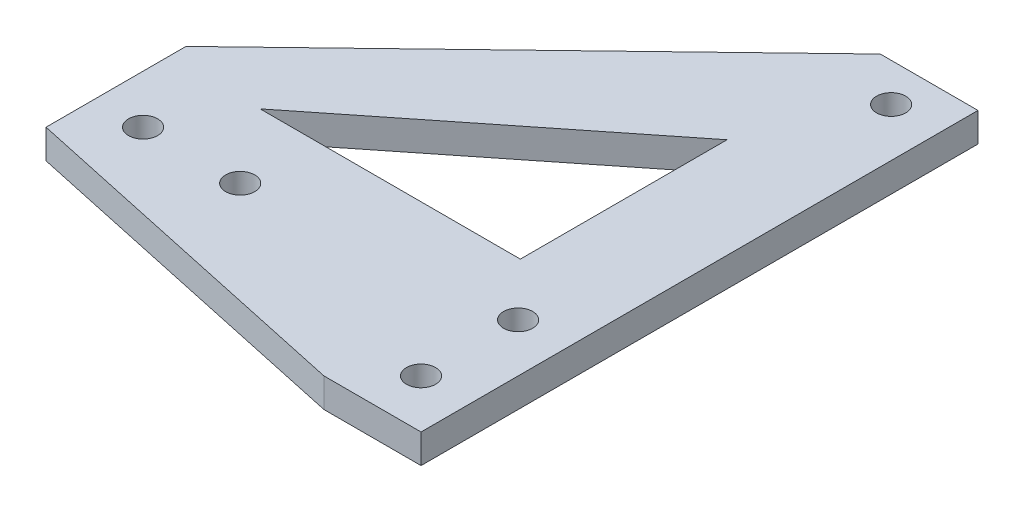
ISO-10303-21;
HEADER;
FILE_DESCRIPTION(('STEP AP214'),'2;1');
FILE_NAME('part.step','',(''),(''),'','','');
FILE_SCHEMA(('AUTOMOTIVE_DESIGN { 1 0 10303 214 1 1 1 1 }'));
ENDSEC;
DATA;
#1=APPLICATION_CONTEXT('core data for automotive mechanical design processes');
#2=APPLICATION_PROTOCOL_DEFINITION('international standard','automotive_design',2000,#1);
#3=PRODUCT_CONTEXT('',#1,'mechanical');
#4=PRODUCT('Part','Part','',(#3));
#5=PRODUCT_RELATED_PRODUCT_CATEGORY('part','',(#4));
#6=PRODUCT_DEFINITION_FORMATION('','',#4);
#7=PRODUCT_DEFINITION_CONTEXT('part definition',#1,'design');
#8=PRODUCT_DEFINITION('design','',#6,#7);
#9=PRODUCT_DEFINITION_SHAPE('','',#8);
#10=(LENGTH_UNIT() NAMED_UNIT(*) SI_UNIT(.MILLI.,.METRE.));
#11=(NAMED_UNIT(*) PLANE_ANGLE_UNIT() SI_UNIT($,.RADIAN.));
#12=(NAMED_UNIT(*) SI_UNIT($,.STERADIAN.) SOLID_ANGLE_UNIT());
#13=UNCERTAINTY_MEASURE_WITH_UNIT(LENGTH_MEASURE(1.E-05),#10,'distance_accuracy_value','');
#14=(GEOMETRIC_REPRESENTATION_CONTEXT(3) GLOBAL_UNCERTAINTY_ASSIGNED_CONTEXT((#13)) GLOBAL_UNIT_ASSIGNED_CONTEXT((#10,
#11,#12)) REPRESENTATION_CONTEXT('',''));
#15=CARTESIAN_POINT('',(0.,0.,0.));
#16=DIRECTION('',(0.,0.,1.));
#17=DIRECTION('',(1.,0.,0.));
#18=AXIS2_PLACEMENT_3D('',#15,#16,#17);
#19=CARTESIAN_POINT('',(0.,3.,64.6));
#20=DIRECTION('',(0.,0.,-1.));
#21=DIRECTION('',(1.,0.,0.));
#22=AXIS2_PLACEMENT_3D('',#19,#20,#21);
#23=PLANE('',#22);
#24=DIRECTION('',(-1.,0.,0.));
#25=VECTOR('',#24,1.);
#26=CARTESIAN_POINT('',(0.,0.,64.6));
#27=LINE('',#26,#25);
#28=CARTESIAN_POINT('',(41.5,0.,64.6));
#29=VERTEX_POINT('',#28);
#30=CARTESIAN_POINT('',(31.5,0.,64.6));
#31=VERTEX_POINT('',#30);
#32=EDGE_CURVE('E177',#29,#31,#27,.T.);
#33=ORIENTED_EDGE('',*,*,#32,.F.);
#34=DIRECTION('',(0.,-1.,0.));
#35=VECTOR('',#34,1.);
#36=CARTESIAN_POINT('',(41.5,3.,64.6));
#37=LINE('',#36,#35);
#38=CARTESIAN_POINT('',(41.5,3.,64.6));
#39=VERTEX_POINT('',#38);
#40=EDGE_CURVE('E176',#39,#29,#37,.T.);
#41=ORIENTED_EDGE('',*,*,#40,.F.);
#42=DIRECTION('',(-1.,0.,0.));
#43=VECTOR('',#42,1.);
#44=CARTESIAN_POINT('',(0.,3.,64.6));
#45=LINE('',#44,#43);
#46=CARTESIAN_POINT('',(31.5,3.,64.6));
#47=VERTEX_POINT('',#46);
#48=EDGE_CURVE('E151',#39,#47,#45,.T.);
#49=ORIENTED_EDGE('',*,*,#48,.T.);
#50=DIRECTION('',(0.,-1.,0.));
#51=VECTOR('',#50,1.);
#52=CARTESIAN_POINT('',(31.5,3.,64.6));
#53=LINE('',#52,#51);
#54=EDGE_CURVE('E205',#47,#31,#53,.T.);
#55=ORIENTED_EDGE('',*,*,#54,.T.);
#56=EDGE_LOOP('',(#33,#41,#49,#55));
#57=FACE_BOUND('',#56,.T.);
#58=ADVANCED_FACE('F43',(#57),#23,.F.);
#59=CARTESIAN_POINT('',(-11.9106417152535,3.,55.2399520466015));
#60=DIRECTION('',(0.210772639150553,0.,-0.97753511168935));
#61=DIRECTION('',(0.977535111689351,0.,0.210772639150553));
#62=AXIS2_PLACEMENT_3D('',#59,#60,#61);
#63=PLANE('',#62);
#64=DIRECTION('',(-0.977535111689351,0.,-0.210772639150553));
#65=VECTOR('',#64,1.);
#66=CARTESIAN_POINT('',(-11.9106417152535,0.,55.2399520466015));
#67=LINE('',#66,#65);
#68=CARTESIAN_POINT('',(-5.,0.,56.73));
#69=VERTEX_POINT('',#68);
#70=EDGE_CURVE('E180',#31,#69,#67,.T.);
#71=ORIENTED_EDGE('',*,*,#70,.F.);
#72=ORIENTED_EDGE('',*,*,#54,.F.);
#73=DIRECTION('',(-0.977535111689351,0.,-0.210772639150553));
#74=VECTOR('',#73,1.);
#75=CARTESIAN_POINT('',(-11.9106417152535,3.,55.2399520466015));
#76=LINE('',#75,#74);
#77=CARTESIAN_POINT('',(-5.,3.,56.73));
#78=VERTEX_POINT('',#77);
#79=EDGE_CURVE('E154',#47,#78,#76,.T.);
#80=ORIENTED_EDGE('',*,*,#79,.T.);
#81=DIRECTION('',(0.,-1.,0.));
#82=VECTOR('',#81,1.);
#83=CARTESIAN_POINT('',(-5.,3.,56.73));
#84=LINE('',#83,#82);
#85=EDGE_CURVE('E202',#78,#69,#84,.T.);
#86=ORIENTED_EDGE('',*,*,#85,.T.);
#87=EDGE_LOOP('',(#71,#72,#80,#86));
#88=FACE_BOUND('',#87,.T.);
#89=ADVANCED_FACE('F233',(#88),#63,.F.);
#90=CARTESIAN_POINT('',(-5.,3.,0.));
#91=DIRECTION('',(1.,0.,0.));
#92=DIRECTION('',(0.,0.,1.));
#93=AXIS2_PLACEMENT_3D('',#90,#91,#92);
#94=PLANE('',#93);
#95=DIRECTION('',(0.,0.,-1.));
#96=VECTOR('',#95,1.);
#97=CARTESIAN_POINT('',(-5.,0.,0.));
#98=LINE('',#97,#96);
#99=CARTESIAN_POINT('',(-5.,0.,42.3127995725989));
#100=VERTEX_POINT('',#99);
#101=EDGE_CURVE('E183',#69,#100,#98,.T.);
#102=ORIENTED_EDGE('',*,*,#101,.F.);
#103=ORIENTED_EDGE('',*,*,#85,.F.);
#104=DIRECTION('',(0.,0.,-1.));
#105=VECTOR('',#104,1.);
#106=CARTESIAN_POINT('',(-5.,3.,0.));
#107=LINE('',#106,#105);
#108=CARTESIAN_POINT('',(-5.,3.,42.3127995725989));
#109=VERTEX_POINT('',#108);
#110=EDGE_CURVE('E158',#78,#109,#107,.T.);
#111=ORIENTED_EDGE('',*,*,#110,.T.);
#112=DIRECTION('',(0.,1.,0.));
#113=VECTOR('',#112,1.);
#114=CARTESIAN_POINT('',(-5.,-4.,42.3127995725989));
#115=LINE('',#114,#113);
#116=EDGE_CURVE('E136',#100,#109,#115,.T.);
#117=ORIENTED_EDGE('',*,*,#116,.F.);
#118=EDGE_LOOP('',(#102,#103,#111,#117));
#119=FACE_BOUND('',#118,.T.);
#120=ADVANCED_FACE('F238',(#119),#94,.F.);
#121=CARTESIAN_POINT('',(36.5,3.,49.6));
#122=DIRECTION('',(0.,-1.,0.));
#123=DIRECTION('',(0.,0.,1.));
#124=AXIS2_PLACEMENT_3D('',#121,#122,#123);
#125=CYLINDRICAL_SURFACE('',#124,1.5);
#126=CARTESIAN_POINT('',(36.5,3.,49.6));
#127=DIRECTION('',(0.,-1.,0.));
#128=DIRECTION('',(0.,0.,-1.));
#129=AXIS2_PLACEMENT_3D('',#126,#127,#128);
#130=CIRCLE('',#129,1.5);
#131=CARTESIAN_POINT('',(36.5,3.,48.1));
#132=VERTEX_POINT('',#131);
#133=EDGE_CURVE('E170',#132,#132,#130,.T.);
#134=ORIENTED_EDGE('',*,*,#133,.F.);
#135=EDGE_LOOP('',(#134));
#136=FACE_BOUND('',#135,.T.);
#137=CARTESIAN_POINT('',(36.5,0.,49.6));
#138=DIRECTION('',(0.,-1.,0.));
#139=DIRECTION('',(0.,0.,-1.));
#140=AXIS2_PLACEMENT_3D('',#137,#138,#139);
#141=CIRCLE('',#140,1.5);
#142=CARTESIAN_POINT('',(36.5,0.,48.1));
#143=VERTEX_POINT('',#142);
#144=EDGE_CURVE('E195',#143,#143,#141,.T.);
#145=ORIENTED_EDGE('',*,*,#144,.T.);
#146=EDGE_LOOP('',(#145));
#147=FACE_BOUND('',#146,.T.);
#148=ADVANCED_FACE('F273',(#136,#147),#125,.F.);
#149=CARTESIAN_POINT('',(36.5,3.,59.6));
#150=DIRECTION('',(0.,-1.,0.));
#151=DIRECTION('',(0.,0.,1.));
#152=AXIS2_PLACEMENT_3D('',#149,#150,#151);
#153=CYLINDRICAL_SURFACE('',#152,1.5);
#154=CARTESIAN_POINT('',(36.5,3.,59.6));
#155=DIRECTION('',(0.,-1.,0.));
#156=DIRECTION('',(0.,0.,-1.));
#157=AXIS2_PLACEMENT_3D('',#154,#155,#156);
#158=CIRCLE('',#157,1.5);
#159=CARTESIAN_POINT('',(36.5,3.,58.1));
#160=VERTEX_POINT('',#159);
#161=EDGE_CURVE('E167',#160,#160,#158,.T.);
#162=ORIENTED_EDGE('',*,*,#161,.F.);
#163=EDGE_LOOP('',(#162));
#164=FACE_BOUND('',#163,.T.);
#165=CARTESIAN_POINT('',(36.5,0.,59.6));
#166=DIRECTION('',(0.,-1.,0.));
#167=DIRECTION('',(0.,0.,-1.));
#168=AXIS2_PLACEMENT_3D('',#165,#166,#167);
#169=CIRCLE('',#168,1.5);
#170=CARTESIAN_POINT('',(36.5,0.,58.1));
#171=VERTEX_POINT('',#170);
#172=EDGE_CURVE('E192',#171,#171,#169,.T.);
#173=ORIENTED_EDGE('',*,*,#172,.T.);
#174=EDGE_LOOP('',(#173));
#175=FACE_BOUND('',#174,.T.);
#176=ADVANCED_FACE('F276',(#164,#175),#153,.F.);
#177=CARTESIAN_POINT('',(36.5,3.,11.18));
#178=DIRECTION('',(0.,-1.,0.));
#179=DIRECTION('',(0.,0.,1.));
#180=AXIS2_PLACEMENT_3D('',#177,#178,#179);
#181=CYLINDRICAL_SURFACE('',#180,1.5);
#182=CARTESIAN_POINT('',(36.5,3.,11.18));
#183=DIRECTION('',(0.,-1.,0.));
#184=DIRECTION('',(0.,0.,-1.));
#185=AXIS2_PLACEMENT_3D('',#182,#183,#184);
#186=CIRCLE('',#185,1.5);
#187=CARTESIAN_POINT('',(36.5,3.,9.67999999999999));
#188=VERTEX_POINT('',#187);
#189=EDGE_CURVE('E164',#188,#188,#186,.T.);
#190=ORIENTED_EDGE('',*,*,#189,.F.);
#191=EDGE_LOOP('',(#190));
#192=FACE_BOUND('',#191,.T.);
#193=CARTESIAN_POINT('',(36.5,0.,11.18));
#194=DIRECTION('',(0.,-1.,0.));
#195=DIRECTION('',(0.,0.,-1.));
#196=AXIS2_PLACEMENT_3D('',#193,#194,#195);
#197=CIRCLE('',#196,1.5);
#198=CARTESIAN_POINT('',(36.5,0.,9.67999999999999));
#199=VERTEX_POINT('',#198);
#200=EDGE_CURVE('E189',#199,#199,#197,.T.);
#201=ORIENTED_EDGE('',*,*,#200,.T.);
#202=EDGE_LOOP('',(#201));
#203=FACE_BOUND('',#202,.T.);
#204=ADVANCED_FACE('F280',(#192,#203),#181,.F.);
#205=CARTESIAN_POINT('',(41.5,3.,0.));
#206=DIRECTION('',(1.,0.,0.));
#207=DIRECTION('',(0.,0.,1.));
#208=AXIS2_PLACEMENT_3D('',#205,#206,#207);
#209=PLANE('',#208);
#210=DIRECTION('',(0.,1.,0.));
#211=VECTOR('',#210,1.);
#212=CARTESIAN_POINT('',(41.5,-4.,7.23402453897604));
#213=LINE('',#212,#211);
#214=CARTESIAN_POINT('',(41.5,0.,7.23402453897604));
#215=VERTEX_POINT('',#214);
#216=CARTESIAN_POINT('',(41.5,3.,7.23402453897604));
#217=VERTEX_POINT('',#216);
#218=EDGE_CURVE('E144',#215,#217,#213,.T.);
#219=ORIENTED_EDGE('',*,*,#218,.T.);
#220=DIRECTION('',(0.,0.,-1.));
#221=VECTOR('',#220,1.);
#222=CARTESIAN_POINT('',(41.5,3.,0.));
#223=LINE('',#222,#221);
#224=EDGE_CURVE('E161',#39,#217,#223,.T.);
#225=ORIENTED_EDGE('',*,*,#224,.F.);
#226=ORIENTED_EDGE('',*,*,#40,.T.);
#227=DIRECTION('',(0.,0.,-1.));
#228=VECTOR('',#227,1.);
#229=CARTESIAN_POINT('',(41.5,0.,0.));
#230=LINE('',#229,#228);
#231=EDGE_CURVE('E186',#29,#215,#230,.T.);
#232=ORIENTED_EDGE('',*,*,#231,.T.);
#233=EDGE_LOOP('',(#219,#225,#226,#232));
#234=FACE_BOUND('',#233,.T.);
#235=ADVANCED_FACE('F248',(#234),#209,.T.);
#236=CARTESIAN_POINT('',(0.,3.,51.73));
#237=DIRECTION('',(0.,-1.,0.));
#238=DIRECTION('',(0.,0.,1.));
#239=AXIS2_PLACEMENT_3D('',#236,#237,#238);
#240=CYLINDRICAL_SURFACE('',#239,1.5);
#241=CARTESIAN_POINT('',(0.,3.,51.73));
#242=DIRECTION('',(0.,-1.,0.));
#243=DIRECTION('',(0.,0.,-1.));
#244=AXIS2_PLACEMENT_3D('',#241,#242,#243);
#245=CIRCLE('',#244,1.5);
#246=CARTESIAN_POINT('',(0.,3.,50.23));
#247=VERTEX_POINT('',#246);
#248=EDGE_CURVE('E173',#247,#247,#245,.T.);
#249=ORIENTED_EDGE('',*,*,#248,.F.);
#250=EDGE_LOOP('',(#249));
#251=FACE_BOUND('',#250,.T.);
#252=CARTESIAN_POINT('',(0.,0.,51.73));
#253=DIRECTION('',(0.,-1.,0.));
#254=DIRECTION('',(0.,0.,-1.));
#255=AXIS2_PLACEMENT_3D('',#252,#253,#254);
#256=CIRCLE('',#255,1.5);
#257=CARTESIAN_POINT('',(0.,0.,50.23));
#258=VERTEX_POINT('',#257);
#259=EDGE_CURVE('E155',#258,#258,#256,.T.);
#260=ORIENTED_EDGE('',*,*,#259,.T.);
#261=EDGE_LOOP('',(#260));
#262=FACE_BOUND('',#261,.T.);
#263=ADVANCED_FACE('F267',(#251,#262),#240,.F.);
#264=CARTESIAN_POINT('',(0.,3.,0.));
#265=DIRECTION('',(0.,1.,0.));
#266=DIRECTION('',(0.,0.,-1.));
#267=AXIS2_PLACEMENT_3D('',#264,#265,#266);
#268=PLANE('',#267);
#269=DIRECTION('',(0.783006018890345,0.,-0.622014127155882));
#270=VECTOR('',#269,1.);
#271=CARTESIAN_POINT('',(4.38834668059727,3.,44.066382221439));
#272=LINE('',#271,#270);
#273=CARTESIAN_POINT('',(4.38834668059727,3.,44.066382221439));
#274=VERTEX_POINT('',#273);
#275=CARTESIAN_POINT('',(31.1931100271531,3.,22.7728786283806));
#276=VERTEX_POINT('',#275);
#277=EDGE_CURVE('E128',#274,#276,#272,.T.);
#278=ORIENTED_EDGE('',*,*,#277,.T.);
#279=DIRECTION('',(0.,0.,1.));
#280=VECTOR('',#279,1.);
#281=CARTESIAN_POINT('',(31.1931100271531,3.,22.7728786283806));
#282=LINE('',#281,#280);
#283=CARTESIAN_POINT('',(31.1931100271531,3.,44.066382221439));
#284=VERTEX_POINT('',#283);
#285=EDGE_CURVE('E114',#276,#284,#282,.T.);
#286=ORIENTED_EDGE('',*,*,#285,.T.);
#287=DIRECTION('',(-1.,0.,0.));
#288=VECTOR('',#287,1.);
#289=CARTESIAN_POINT('',(31.1931100271531,3.,44.066382221439));
#290=LINE('',#289,#288);
#291=EDGE_CURVE('E122',#284,#274,#290,.T.);
#292=ORIENTED_EDGE('',*,*,#291,.T.);
#293=EDGE_LOOP('',(#278,#286,#292));
#294=FACE_BOUND('',#293,.T.);
#295=DIRECTION('',(-0.720469182110105,0.,0.693486955630455));
#296=VECTOR('',#295,1.);
#297=CARTESIAN_POINT('',(31.4436218341303,3.,7.23402453897604));
#298=LINE('',#297,#296);
#299=CARTESIAN_POINT('',(31.4436218341303,3.,7.23402453897604));
#300=VERTEX_POINT('',#299);
#301=EDGE_CURVE('E132',#300,#109,#298,.T.);
#302=ORIENTED_EDGE('',*,*,#301,.T.);
#303=ORIENTED_EDGE('',*,*,#110,.F.);
#304=ORIENTED_EDGE('',*,*,#79,.F.);
#305=ORIENTED_EDGE('',*,*,#48,.F.);
#306=ORIENTED_EDGE('',*,*,#224,.T.);
#307=DIRECTION('',(-1.,0.,0.));
#308=VECTOR('',#307,1.);
#309=CARTESIAN_POINT('',(-5.,3.,7.23402453897604));
#310=LINE('',#309,#308);
#311=EDGE_CURVE('E141',#217,#300,#310,.T.);
#312=ORIENTED_EDGE('',*,*,#311,.T.);
#313=EDGE_LOOP('',(#302,#303,#304,#305,#306,#312));
#314=FACE_BOUND('',#313,.T.);
#315=CARTESIAN_POINT('',(10.,3.,51.73));
#316=DIRECTION('',(0.,-1.,0.));
#317=DIRECTION('',(0.,0.,-1.));
#318=AXIS2_PLACEMENT_3D('',#315,#316,#317);
#319=CIRCLE('',#318,1.5);
#320=CARTESIAN_POINT('',(10.,3.,50.23));
#321=VERTEX_POINT('',#320);
#322=EDGE_CURVE('E147',#321,#321,#319,.T.);
#323=ORIENTED_EDGE('',*,*,#322,.T.);
#324=EDGE_LOOP('',(#323));
#325=FACE_BOUND('',#324,.T.);
#326=ORIENTED_EDGE('',*,*,#189,.T.);
#327=EDGE_LOOP('',(#326));
#328=FACE_BOUND('',#327,.T.);
#329=ORIENTED_EDGE('',*,*,#161,.T.);
#330=EDGE_LOOP('',(#329));
#331=FACE_BOUND('',#330,.T.);
#332=ORIENTED_EDGE('',*,*,#133,.T.);
#333=EDGE_LOOP('',(#332));
#334=FACE_BOUND('',#333,.T.);
#335=ORIENTED_EDGE('',*,*,#248,.T.);
#336=EDGE_LOOP('',(#335));
#337=FACE_BOUND('',#336,.T.);
#338=ADVANCED_FACE('F126',(#294,#314,#325,#328,#331,#334,#337),#268,.T.);
#339=CARTESIAN_POINT('',(0.,0.,0.));
#340=DIRECTION('',(0.,1.,0.));
#341=DIRECTION('',(0.,0.,-1.));
#342=AXIS2_PLACEMENT_3D('',#339,#340,#341);
#343=PLANE('',#342);
#344=DIRECTION('',(-1.,0.,0.));
#345=VECTOR('',#344,1.);
#346=CARTESIAN_POINT('',(0.,0.,44.066382221439));
#347=LINE('',#346,#345);
#348=CARTESIAN_POINT('',(31.1931100271531,0.,44.066382221439));
#349=VERTEX_POINT('',#348);
#350=CARTESIAN_POINT('',(4.38834668059727,0.,44.066382221439));
#351=VERTEX_POINT('',#350);
#352=EDGE_CURVE('E50',#349,#351,#347,.T.);
#353=ORIENTED_EDGE('',*,*,#352,.F.);
#354=DIRECTION('',(0.,0.,1.));
#355=VECTOR('',#354,1.);
#356=CARTESIAN_POINT('',(31.1931100271531,0.,0.));
#357=LINE('',#356,#355);
#358=CARTESIAN_POINT('',(31.1931100271531,0.,22.7728786283806));
#359=VERTEX_POINT('',#358);
#360=EDGE_CURVE('E117',#359,#349,#357,.T.);
#361=ORIENTED_EDGE('',*,*,#360,.F.);
#362=DIRECTION('',(0.783006018890345,0.,-0.622014127155882));
#363=VECTOR('',#362,1.);
#364=CARTESIAN_POINT('',(23.1599845277553,0.,29.1543334643508));
#365=LINE('',#364,#363);
#366=EDGE_CURVE('E11',#351,#359,#365,.T.);
#367=ORIENTED_EDGE('',*,*,#366,.F.);
#368=EDGE_LOOP('',(#353,#361,#367));
#369=FACE_BOUND('',#368,.T.);
#370=CARTESIAN_POINT('',(10.,0.,51.73));
#371=DIRECTION('',(0.,-1.,0.));
#372=DIRECTION('',(0.,0.,-1.));
#373=AXIS2_PLACEMENT_3D('',#370,#371,#372);
#374=CIRCLE('',#373,1.5);
#375=CARTESIAN_POINT('',(10.,0.,50.23));
#376=VERTEX_POINT('',#375);
#377=EDGE_CURVE('E150',#376,#376,#374,.T.);
#378=ORIENTED_EDGE('',*,*,#377,.F.);
#379=EDGE_LOOP('',(#378));
#380=FACE_BOUND('',#379,.T.);
#381=DIRECTION('',(-1.,0.,0.));
#382=VECTOR('',#381,1.);
#383=CARTESIAN_POINT('',(0.,0.,7.23402453897604));
#384=LINE('',#383,#382);
#385=CARTESIAN_POINT('',(31.4436218341303,0.,7.23402453897604));
#386=VERTEX_POINT('',#385);
#387=EDGE_CURVE('E208',#215,#386,#384,.T.);
#388=ORIENTED_EDGE('',*,*,#387,.F.);
#389=ORIENTED_EDGE('',*,*,#231,.F.);
#390=ORIENTED_EDGE('',*,*,#32,.T.);
#391=ORIENTED_EDGE('',*,*,#70,.T.);
#392=ORIENTED_EDGE('',*,*,#101,.T.);
#393=DIRECTION('',(-0.720469182110105,0.,0.693486955630455));
#394=VECTOR('',#393,1.);
#395=CARTESIAN_POINT('',(18.7363762813039,0.,19.4653721825613));
#396=LINE('',#395,#394);
#397=EDGE_CURVE('E139',#386,#100,#396,.T.);
#398=ORIENTED_EDGE('',*,*,#397,.F.);
#399=EDGE_LOOP('',(#388,#389,#390,#391,#392,#398));
#400=FACE_BOUND('',#399,.T.);
#401=ORIENTED_EDGE('',*,*,#200,.F.);
#402=EDGE_LOOP('',(#401));
#403=FACE_BOUND('',#402,.T.);
#404=ORIENTED_EDGE('',*,*,#172,.F.);
#405=EDGE_LOOP('',(#404));
#406=FACE_BOUND('',#405,.T.);
#407=ORIENTED_EDGE('',*,*,#144,.F.);
#408=EDGE_LOOP('',(#407));
#409=FACE_BOUND('',#408,.T.);
#410=ORIENTED_EDGE('',*,*,#259,.F.);
#411=EDGE_LOOP('',(#410));
#412=FACE_BOUND('',#411,.T.);
#413=ADVANCED_FACE('F217',(#369,#380,#400,#403,#406,#409,#412),#343,.F.);
#414=CARTESIAN_POINT('',(10.,-4.,51.73));
#415=DIRECTION('',(0.,1.,0.));
#416=DIRECTION('',(0.,0.,-1.));
#417=AXIS2_PLACEMENT_3D('',#414,#415,#416);
#418=CYLINDRICAL_SURFACE('',#417,1.5);
#419=ORIENTED_EDGE('',*,*,#322,.F.);
#420=EDGE_LOOP('',(#419));
#421=FACE_BOUND('',#420,.T.);
#422=ORIENTED_EDGE('',*,*,#377,.T.);
#423=EDGE_LOOP('',(#422));
#424=FACE_BOUND('',#423,.T.);
#425=ADVANCED_FACE('F257',(#421,#424),#418,.F.);
#426=CARTESIAN_POINT('',(-5.,-4.,7.23402453897604));
#427=DIRECTION('',(0.,0.,1.));
#428=DIRECTION('',(-1.,0.,0.));
#429=AXIS2_PLACEMENT_3D('',#426,#427,#428);
#430=PLANE('',#429);
#431=ORIENTED_EDGE('',*,*,#311,.F.);
#432=ORIENTED_EDGE('',*,*,#218,.F.);
#433=ORIENTED_EDGE('',*,*,#387,.T.);
#434=DIRECTION('',(0.,-1.,0.));
#435=VECTOR('',#434,1.);
#436=CARTESIAN_POINT('',(31.4436218341303,-4.,7.23402453897604));
#437=LINE('',#436,#435);
#438=EDGE_CURVE('E213',#300,#386,#437,.T.);
#439=ORIENTED_EDGE('',*,*,#438,.F.);
#440=EDGE_LOOP('',(#431,#432,#433,#439));
#441=FACE_BOUND('',#440,.T.);
#442=ADVANCED_FACE('F228',(#441),#430,.F.);
#443=CARTESIAN_POINT('',(31.4436218341303,-4.,7.23402453897604));
#444=DIRECTION('',(0.693486955630455,0.,0.720469182110105));
#445=DIRECTION('',(-0.720469182110105,0.,0.693486955630455));
#446=AXIS2_PLACEMENT_3D('',#443,#444,#445);
#447=PLANE('',#446);
#448=ORIENTED_EDGE('',*,*,#438,.T.);
#449=ORIENTED_EDGE('',*,*,#397,.T.);
#450=ORIENTED_EDGE('',*,*,#116,.T.);
#451=ORIENTED_EDGE('',*,*,#301,.F.);
#452=EDGE_LOOP('',(#448,#449,#450,#451));
#453=FACE_BOUND('',#452,.T.);
#454=ADVANCED_FACE('F221',(#453),#447,.F.);
#455=CARTESIAN_POINT('',(4.38834668059727,-4.,44.066382221439));
#456=DIRECTION('',(-0.622014127155882,0.,-0.783006018890345));
#457=DIRECTION('',(0.783006018890345,0.,-0.622014127155882));
#458=AXIS2_PLACEMENT_3D('',#455,#456,#457);
#459=PLANE('',#458);
#460=DIRECTION('',(0.,1.,0.));
#461=VECTOR('',#460,1.);
#462=CARTESIAN_POINT('',(4.38834668059727,-4.,44.066382221439));
#463=LINE('',#462,#461);
#464=EDGE_CURVE('E119',#351,#274,#463,.T.);
#465=ORIENTED_EDGE('',*,*,#464,.F.);
#466=ORIENTED_EDGE('',*,*,#366,.T.);
#467=DIRECTION('',(0.,1.,0.));
#468=VECTOR('',#467,1.);
#469=CARTESIAN_POINT('',(31.1931100271531,-4.,22.7728786283806));
#470=LINE('',#469,#468);
#471=EDGE_CURVE('E56',#359,#276,#470,.T.);
#472=ORIENTED_EDGE('',*,*,#471,.T.);
#473=ORIENTED_EDGE('',*,*,#277,.F.);
#474=EDGE_LOOP('',(#465,#466,#472,#473));
#475=FACE_BOUND('',#474,.T.);
#476=ADVANCED_FACE('F219',(#475),#459,.F.);
#477=CARTESIAN_POINT('',(31.1931100271531,-4.,44.066382221439));
#478=DIRECTION('',(0.,0.,1.));
#479=DIRECTION('',(-1.,0.,0.));
#480=AXIS2_PLACEMENT_3D('',#477,#478,#479);
#481=PLANE('',#480);
#482=DIRECTION('',(0.,1.,0.));
#483=VECTOR('',#482,1.);
#484=CARTESIAN_POINT('',(31.1931100271531,-4.,44.066382221439));
#485=LINE('',#484,#483);
#486=EDGE_CURVE('E64',#349,#284,#485,.T.);
#487=ORIENTED_EDGE('',*,*,#486,.F.);
#488=ORIENTED_EDGE('',*,*,#352,.T.);
#489=ORIENTED_EDGE('',*,*,#464,.T.);
#490=ORIENTED_EDGE('',*,*,#291,.F.);
#491=EDGE_LOOP('',(#487,#488,#489,#490));
#492=FACE_BOUND('',#491,.T.);
#493=ADVANCED_FACE('F123',(#492),#481,.F.);
#494=CARTESIAN_POINT('',(31.1931100271531,-4.,22.7728786283806));
#495=DIRECTION('',(1.,0.,0.));
#496=DIRECTION('',(0.,0.,1.));
#497=AXIS2_PLACEMENT_3D('',#494,#495,#496);
#498=PLANE('',#497);
#499=ORIENTED_EDGE('',*,*,#471,.F.);
#500=ORIENTED_EDGE('',*,*,#360,.T.);
#501=ORIENTED_EDGE('',*,*,#486,.T.);
#502=ORIENTED_EDGE('',*,*,#285,.F.);
#503=EDGE_LOOP('',(#499,#500,#501,#502));
#504=FACE_BOUND('',#503,.T.);
#505=ADVANCED_FACE('F112',(#504),#498,.F.);
#506=CLOSED_SHELL('',(#58,#89,#120,#148,#176,#204,#235,#263,#338,#413,#425,#442,#454,#476,#493,#505));
#507=MANIFOLD_SOLID_BREP('B2',#506);
#508=ADVANCED_BREP_SHAPE_REPRESENTATION('',(#18,#507),#14);
#509=SHAPE_DEFINITION_REPRESENTATION(#9,#508);
ENDSEC;
END-ISO-10303-21;
